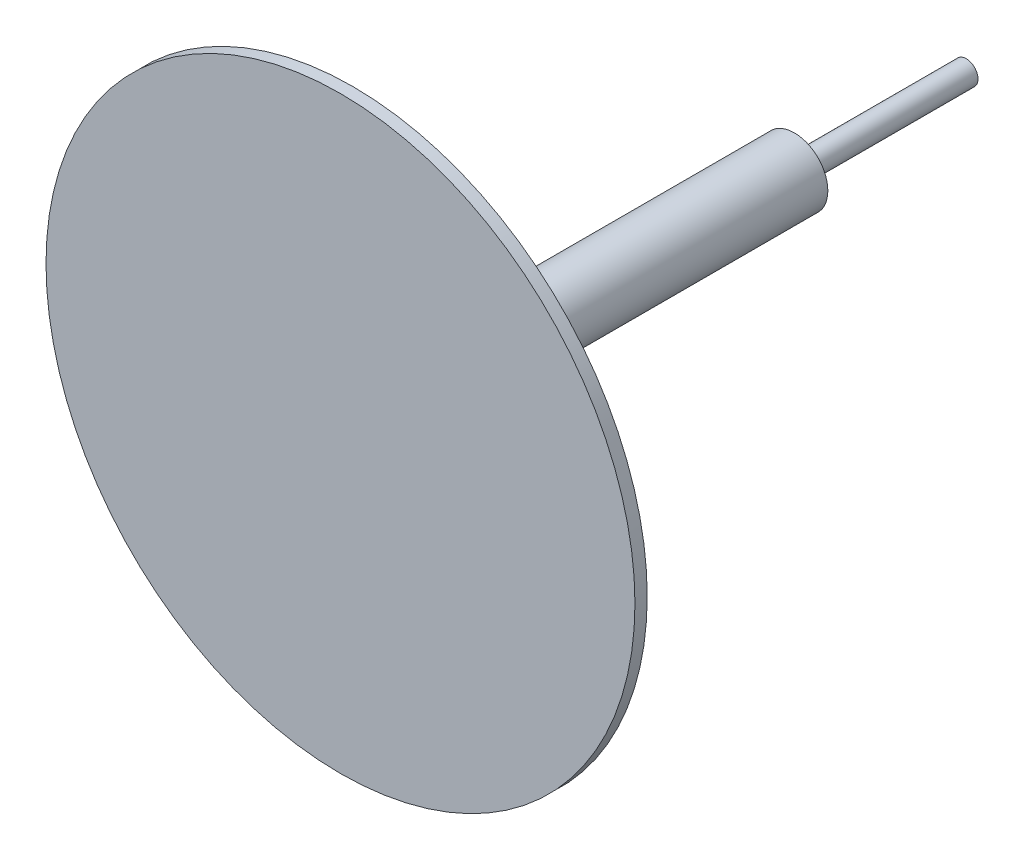
ISO-10303-21;
HEADER;
FILE_DESCRIPTION(('STEP AP214'),'2;1');
FILE_NAME('part.step','',(''),(''),'','','');
FILE_SCHEMA(('AUTOMOTIVE_DESIGN { 1 0 10303 214 1 1 1 1 }'));
ENDSEC;
DATA;
#1=APPLICATION_CONTEXT('core data for automotive mechanical design processes');
#2=APPLICATION_PROTOCOL_DEFINITION('international standard','automotive_design',2000,#1);
#3=PRODUCT_CONTEXT('',#1,'mechanical');
#4=PRODUCT('Part','Part','',(#3));
#5=PRODUCT_RELATED_PRODUCT_CATEGORY('part','',(#4));
#6=PRODUCT_DEFINITION_FORMATION('','',#4);
#7=PRODUCT_DEFINITION_CONTEXT('part definition',#1,'design');
#8=PRODUCT_DEFINITION('design','',#6,#7);
#9=PRODUCT_DEFINITION_SHAPE('','',#8);
#10=(LENGTH_UNIT() NAMED_UNIT(*) SI_UNIT(.MILLI.,.METRE.));
#11=(NAMED_UNIT(*) PLANE_ANGLE_UNIT() SI_UNIT($,.RADIAN.));
#12=(NAMED_UNIT(*) SI_UNIT($,.STERADIAN.) SOLID_ANGLE_UNIT());
#13=UNCERTAINTY_MEASURE_WITH_UNIT(LENGTH_MEASURE(1.E-05),#10,'distance_accuracy_value','');
#14=(GEOMETRIC_REPRESENTATION_CONTEXT(3) GLOBAL_UNCERTAINTY_ASSIGNED_CONTEXT((#13)) GLOBAL_UNIT_ASSIGNED_CONTEXT((#10,
#11,#12)) REPRESENTATION_CONTEXT('',''));
#15=CARTESIAN_POINT('',(0.,0.,0.));
#16=DIRECTION('',(0.,0.,1.));
#17=DIRECTION('',(1.,0.,0.));
#18=AXIS2_PLACEMENT_3D('',#15,#16,#17);
#19=CARTESIAN_POINT('',(0.,0.,-22.86));
#20=DIRECTION('',(0.,0.,-1.));
#21=DIRECTION('',(-1.,0.,0.));
#22=AXIS2_PLACEMENT_3D('',#19,#20,#21);
#23=PLANE('',#22);
#24=CARTESIAN_POINT('',(0.,0.,-22.86));
#25=DIRECTION('',(0.,0.,-1.));
#26=DIRECTION('',(-1.,0.,0.));
#27=AXIS2_PLACEMENT_3D('',#24,#25,#26);
#28=CIRCLE('',#27,1.7272);
#29=CARTESIAN_POINT('',(-1.7272,0.,-22.86));
#30=VERTEX_POINT('',#29);
#31=EDGE_CURVE('E46',#30,#30,#28,.T.);
#32=ORIENTED_EDGE('',*,*,#31,.T.);
#33=EDGE_LOOP('',(#32));
#34=FACE_BOUND('',#33,.T.);
#35=CARTESIAN_POINT('',(0.,0.,-22.86));
#36=DIRECTION('',(0.,0.,-1.));
#37=DIRECTION('',(-1.,0.,0.));
#38=AXIS2_PLACEMENT_3D('',#35,#36,#37);
#39=CIRCLE('',#38,0.6096);
#40=CARTESIAN_POINT('',(-0.6096,0.,-22.86));
#41=VERTEX_POINT('',#40);
#42=EDGE_CURVE('E51',#41,#41,#39,.T.);
#43=ORIENTED_EDGE('',*,*,#42,.F.);
#44=EDGE_LOOP('',(#43));
#45=FACE_BOUND('',#44,.T.);
#46=ADVANCED_FACE('F30',(#34,#45),#23,.T.);
#47=CARTESIAN_POINT('',(0.,0.,0.));
#48=DIRECTION('',(0.,0.,1.));
#49=DIRECTION('',(1.,0.,0.));
#50=AXIS2_PLACEMENT_3D('',#47,#48,#49);
#51=PLANE('',#50);
#52=CARTESIAN_POINT('',(0.,0.,0.));
#53=DIRECTION('',(0.,0.,1.));
#54=DIRECTION('',(1.,0.,0.));
#55=AXIS2_PLACEMENT_3D('',#52,#53,#54);
#56=CIRCLE('',#55,15.24);
#57=CARTESIAN_POINT('',(15.24,0.,0.));
#58=VERTEX_POINT('',#57);
#59=EDGE_CURVE('E41',#58,#58,#56,.T.);
#60=ORIENTED_EDGE('',*,*,#59,.F.);
#61=EDGE_LOOP('',(#60));
#62=FACE_BOUND('',#61,.T.);
#63=CARTESIAN_POINT('',(0.,0.,0.));
#64=DIRECTION('',(0.,0.,1.));
#65=DIRECTION('',(1.,0.,0.));
#66=AXIS2_PLACEMENT_3D('',#63,#64,#65);
#67=CIRCLE('',#66,1.7272);
#68=CARTESIAN_POINT('',(1.7272,0.,0.));
#69=VERTEX_POINT('',#68);
#70=EDGE_CURVE('E10',#69,#69,#67,.F.);
#71=ORIENTED_EDGE('',*,*,#70,.F.);
#72=EDGE_LOOP('',(#71));
#73=FACE_BOUND('',#72,.T.);
#74=ADVANCED_FACE('F67',(#62,#73),#51,.F.);
#75=CARTESIAN_POINT('',(0.,0.,0.635));
#76=DIRECTION('',(0.,0.,-1.));
#77=DIRECTION('',(-1.,0.,0.));
#78=AXIS2_PLACEMENT_3D('',#75,#76,#77);
#79=CYLINDRICAL_SURFACE('',#78,15.24);
#80=CARTESIAN_POINT('',(0.,0.,0.635));
#81=DIRECTION('',(0.,0.,1.));
#82=DIRECTION('',(1.,0.,0.));
#83=AXIS2_PLACEMENT_3D('',#80,#81,#82);
#84=CIRCLE('',#83,15.24);
#85=CARTESIAN_POINT('',(15.24,0.,0.635));
#86=VERTEX_POINT('',#85);
#87=EDGE_CURVE('E37',#86,#86,#84,.T.);
#88=ORIENTED_EDGE('',*,*,#87,.F.);
#89=EDGE_LOOP('',(#88));
#90=FACE_BOUND('',#89,.T.);
#91=ORIENTED_EDGE('',*,*,#59,.T.);
#92=EDGE_LOOP('',(#91));
#93=FACE_BOUND('',#92,.T.);
#94=ADVANCED_FACE('F32',(#90,#93),#79,.T.);
#95=CARTESIAN_POINT('',(0.,0.,0.635));
#96=DIRECTION('',(0.,0.,1.));
#97=DIRECTION('',(1.,0.,0.));
#98=AXIS2_PLACEMENT_3D('',#95,#96,#97);
#99=PLANE('',#98);
#100=ORIENTED_EDGE('',*,*,#87,.T.);
#101=EDGE_LOOP('',(#100));
#102=FACE_BOUND('',#101,.T.);
#103=ADVANCED_FACE('F78',(#102),#99,.T.);
#104=CARTESIAN_POINT('',(0.,0.,-22.86));
#105=DIRECTION('',(0.,0.,1.));
#106=DIRECTION('',(1.,0.,0.));
#107=AXIS2_PLACEMENT_3D('',#104,#105,#106);
#108=CYLINDRICAL_SURFACE('',#107,1.7272);
#109=ORIENTED_EDGE('',*,*,#31,.F.);
#110=EDGE_LOOP('',(#109));
#111=FACE_BOUND('',#110,.T.);
#112=ORIENTED_EDGE('',*,*,#70,.T.);
#113=EDGE_LOOP('',(#112));
#114=FACE_BOUND('',#113,.T.);
#115=ADVANCED_FACE('F62',(#111,#114),#108,.T.);
#116=CARTESIAN_POINT('',(0.,0.,-31.75));
#117=DIRECTION('',(0.,0.,1.));
#118=DIRECTION('',(1.,0.,0.));
#119=AXIS2_PLACEMENT_3D('',#116,#117,#118);
#120=CYLINDRICAL_SURFACE('',#119,0.6096);
#121=CARTESIAN_POINT('',(0.,0.,-31.75));
#122=DIRECTION('',(0.,0.,-1.));
#123=DIRECTION('',(-1.,0.,0.));
#124=AXIS2_PLACEMENT_3D('',#121,#122,#123);
#125=CIRCLE('',#124,0.6096);
#126=CARTESIAN_POINT('',(-0.6096,0.,-31.75));
#127=VERTEX_POINT('',#126);
#128=EDGE_CURVE('E50',#127,#127,#125,.T.);
#129=ORIENTED_EDGE('',*,*,#128,.F.);
#130=EDGE_LOOP('',(#129));
#131=FACE_BOUND('',#130,.T.);
#132=ORIENTED_EDGE('',*,*,#42,.T.);
#133=EDGE_LOOP('',(#132));
#134=FACE_BOUND('',#133,.T.);
#135=ADVANCED_FACE('F59',(#131,#134),#120,.T.);
#136=CARTESIAN_POINT('',(0.,0.,-31.75));
#137=DIRECTION('',(0.,0.,-1.));
#138=DIRECTION('',(-1.,0.,0.));
#139=AXIS2_PLACEMENT_3D('',#136,#137,#138);
#140=PLANE('',#139);
#141=ORIENTED_EDGE('',*,*,#128,.T.);
#142=EDGE_LOOP('',(#141));
#143=FACE_BOUND('',#142,.T.);
#144=ADVANCED_FACE('F57',(#143),#140,.T.);
#145=CLOSED_SHELL('',(#46,#74,#94,#103,#115,#135,#144));
#146=MANIFOLD_SOLID_BREP('B2',#145);
#147=ADVANCED_BREP_SHAPE_REPRESENTATION('',(#18,#146),#14);
#148=SHAPE_DEFINITION_REPRESENTATION(#9,#147);
ENDSEC;
END-ISO-10303-21;
